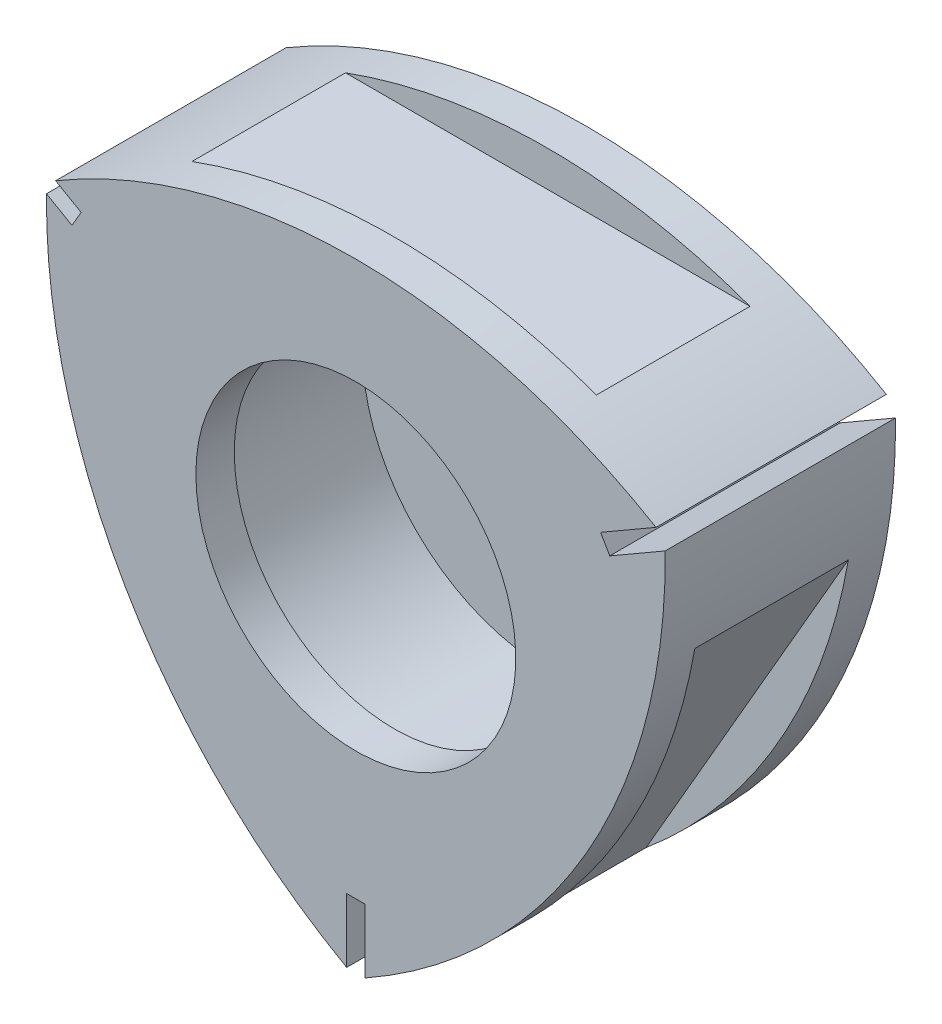
ISO-10303-21;
HEADER;
FILE_DESCRIPTION(('STEP AP214'),'2;1');
FILE_NAME('part.step','',(''),(''),'','','');
FILE_SCHEMA(('AUTOMOTIVE_DESIGN { 1 0 10303 214 1 1 1 1 }'));
ENDSEC;
DATA;
#1=APPLICATION_CONTEXT('core data for automotive mechanical design processes');
#2=APPLICATION_PROTOCOL_DEFINITION('international standard','automotive_design',2000,#1);
#3=PRODUCT_CONTEXT('',#1,'mechanical');
#4=PRODUCT('Part','Part','',(#3));
#5=PRODUCT_RELATED_PRODUCT_CATEGORY('part','',(#4));
#6=PRODUCT_DEFINITION_FORMATION('','',#4);
#7=PRODUCT_DEFINITION_CONTEXT('part definition',#1,'design');
#8=PRODUCT_DEFINITION('design','',#6,#7);
#9=PRODUCT_DEFINITION_SHAPE('','',#8);
#10=(LENGTH_UNIT() NAMED_UNIT(*) SI_UNIT(.MILLI.,.METRE.));
#11=(NAMED_UNIT(*) PLANE_ANGLE_UNIT() SI_UNIT($,.RADIAN.));
#12=(NAMED_UNIT(*) SI_UNIT($,.STERADIAN.) SOLID_ANGLE_UNIT());
#13=UNCERTAINTY_MEASURE_WITH_UNIT(LENGTH_MEASURE(1.E-05),#10,'distance_accuracy_value','');
#14=(GEOMETRIC_REPRESENTATION_CONTEXT(3) GLOBAL_UNCERTAINTY_ASSIGNED_CONTEXT((#13)) GLOBAL_UNIT_ASSIGNED_CONTEXT((#10,
#11,#12)) REPRESENTATION_CONTEXT('',''));
#15=CARTESIAN_POINT('',(0.,0.,0.));
#16=DIRECTION('',(0.,0.,1.));
#17=DIRECTION('',(1.,0.,0.));
#18=AXIS2_PLACEMENT_3D('',#15,#16,#17);
#19=CARTESIAN_POINT('',(-21.8238401709114,12.5999997743161,18.));
#20=DIRECTION('',(0.,0.,1.));
#21=DIRECTION('',(1.,0.,0.));
#22=AXIS2_PLACEMENT_3D('',#19,#20,#21);
#23=PLANE('',#22);
#24=CARTESIAN_POINT('',(-21.8238401709114,12.5999997743161,18.));
#25=DIRECTION('',(0.,0.,1.));
#26=DIRECTION('',(1.,0.,0.));
#27=AXIS2_PLACEMENT_3D('',#24,#25,#26);
#28=CIRCLE('',#27,46.);
#29=CARTESIAN_POINT('',(0.714793524428467,-27.500000115301,18.));
#30=VERTEX_POINT('',#29);
#31=CARTESIAN_POINT('',(24.1730952677357,13.1309708214793,18.));
#32=VERTEX_POINT('',#31);
#33=EDGE_CURVE('E247',#30,#32,#28,.T.);
#34=ORIENTED_EDGE('',*,*,#33,.T.);
#35=DIRECTION('',(-0.866025403784439,-0.5,0.));
#36=VECTOR('',#35,1.);
#37=CARTESIAN_POINT('',(24.1730952677357,13.1309708214793,18.));
#38=LINE('',#37,#36);
#39=CARTESIAN_POINT('',(19.8429682488135,10.6309708214793,18.));
#40=VERTEX_POINT('',#39);
#41=EDGE_CURVE('E245',#32,#40,#38,.T.);
#42=ORIENTED_EDGE('',*,*,#41,.T.);
#43=DIRECTION('',(-0.500000000000001,0.866025403784438,0.));
#44=VECTOR('',#43,1.);
#45=CARTESIAN_POINT('',(19.4855715863791,11.2499999992713,18.));
#46=LINE('',#45,#44);
#47=CARTESIAN_POINT('',(19.1281749245879,11.8690291759491,18.));
#48=VERTEX_POINT('',#47);
#49=EDGE_CURVE('E243',#40,#48,#46,.T.);
#50=ORIENTED_EDGE('',*,*,#49,.T.);
#51=DIRECTION('',(0.866025403784439,0.5,0.));
#52=VECTOR('',#51,1.);
#53=CARTESIAN_POINT('',(23.4583019435101,14.3690291759491,18.));
#54=LINE('',#53,#52);
#55=CARTESIAN_POINT('',(23.4583019435101,14.3690291759491,18.));
#56=VERTEX_POINT('',#55);
#57=EDGE_CURVE('E241',#48,#56,#54,.T.);
#58=ORIENTED_EDGE('',*,*,#57,.T.);
#59=CARTESIAN_POINT('',(0.,-25.2,18.));
#60=DIRECTION('',(0.,0.,1.));
#61=DIRECTION('',(1.,0.,0.));
#62=AXIS2_PLACEMENT_3D('',#59,#60,#61);
#63=CIRCLE('',#62,46.);
#64=CARTESIAN_POINT('',(-23.4583019435102,14.3690291759491,18.));
#65=VERTEX_POINT('',#64);
#66=EDGE_CURVE('E239',#56,#65,#63,.T.);
#67=ORIENTED_EDGE('',*,*,#66,.T.);
#68=DIRECTION('',(0.866025403784439,-0.5,0.));
#69=VECTOR('',#68,1.);
#70=CARTESIAN_POINT('',(-23.4583019435102,14.3690291759491,18.));
#71=LINE('',#70,#69);
#72=CARTESIAN_POINT('',(-21.4664434131332,13.2190291172483,18.));
#73=VERTEX_POINT('',#72);
#74=EDGE_CURVE('E237',#65,#73,#71,.T.);
#75=ORIENTED_EDGE('',*,*,#74,.T.);
#76=DIRECTION('',(-0.5,-0.866025403784439,0.));
#77=VECTOR('',#76,1.);
#78=CARTESIAN_POINT('',(-21.8238401709114,12.5999997743161,18.));
#79=LINE('',#78,#77);
#80=CARTESIAN_POINT('',(-22.1812367367378,11.9809707638541,18.));
#81=VERTEX_POINT('',#80);
#82=EDGE_CURVE('E235',#73,#81,#79,.T.);
#83=ORIENTED_EDGE('',*,*,#82,.T.);
#84=DIRECTION('',(-0.866025403784439,0.5,0.));
#85=VECTOR('',#84,1.);
#86=CARTESIAN_POINT('',(-24.1730952671147,13.1309708225549,18.));
#87=LINE('',#86,#85);
#88=CARTESIAN_POINT('',(-24.1730952671147,13.1309708225549,18.));
#89=VERTEX_POINT('',#88);
#90=EDGE_CURVE('E233',#81,#89,#87,.T.);
#91=ORIENTED_EDGE('',*,*,#90,.T.);
#92=CARTESIAN_POINT('',(21.8238417480671,12.5999998722023,18.));
#93=DIRECTION('',(0.,0.,1.));
#94=DIRECTION('',(-1.,0.,0.));
#95=AXIS2_PLACEMENT_3D('',#92,#93,#94);
#96=CIRCLE('',#95,46.0000015753122);
#97=CARTESIAN_POINT('',(-0.714793876634833,-27.5000001669049,18.));
#98=VERTEX_POINT('',#97);
#99=EDGE_CURVE('E231',#89,#98,#96,.T.);
#100=ORIENTED_EDGE('',*,*,#99,.T.);
#101=DIRECTION('',(0.,1.,0.));
#102=VECTOR('',#101,1.);
#103=CARTESIAN_POINT('',(-0.714793847630263,-27.500000115301,18.));
#104=LINE('',#103,#102);
#105=CARTESIAN_POINT('',(-0.714793847630263,-22.5000001152989,18.));
#106=VERTEX_POINT('',#105);
#107=EDGE_CURVE('E229',#98,#106,#104,.T.);
#108=ORIENTED_EDGE('',*,*,#107,.T.);
#109=DIRECTION('',(1.,0.,0.));
#110=VECTOR('',#109,1.);
#111=CARTESIAN_POINT('',(0.,-22.5000001152989,18.));
#112=LINE('',#111,#110);
#113=CARTESIAN_POINT('',(0.714793524428464,-22.5000001152989,18.));
#114=VERTEX_POINT('',#113);
#115=EDGE_CURVE('E227',#106,#114,#112,.T.);
#116=ORIENTED_EDGE('',*,*,#115,.T.);
#117=DIRECTION('',(0.,-1.,0.));
#118=VECTOR('',#117,1.);
#119=CARTESIAN_POINT('',(0.714793524428467,-27.500000115301,18.));
#120=LINE('',#119,#118);
#121=EDGE_CURVE('E225',#114,#30,#120,.T.);
#122=ORIENTED_EDGE('',*,*,#121,.T.);
#123=EDGE_LOOP('',(#34,#42,#50,#58,#67,#75,#83,#91,#100,#108,#116,#122));
#124=FACE_BOUND('',#123,.T.);
#125=CARTESIAN_POINT('',(0.,0.,18.));
#126=DIRECTION('',(0.,0.,-1.));
#127=DIRECTION('',(-1.,0.,0.));
#128=AXIS2_PLACEMENT_3D('',#125,#126,#127);
#129=CIRCLE('',#128,12.5);
#130=CARTESIAN_POINT('',(-12.5,0.,18.));
#131=VERTEX_POINT('',#130);
#132=EDGE_CURVE('E298',#131,#131,#129,.T.);
#133=ORIENTED_EDGE('',*,*,#132,.T.);
#134=EDGE_LOOP('',(#133));
#135=FACE_BOUND('',#134,.T.);
#136=ADVANCED_FACE('F26',(#124,#135),#23,.T.);
#137=CARTESIAN_POINT('',(0.,-25.2,18.));
#138=DIRECTION('',(0.,0.,-1.));
#139=DIRECTION('',(-1.,0.,0.));
#140=AXIS2_PLACEMENT_3D('',#137,#138,#139);
#141=CYLINDRICAL_SURFACE('',#140,46.);
#142=CARTESIAN_POINT('',(0.,-25.2,0.));
#143=DIRECTION('',(0.,0.,1.));
#144=DIRECTION('',(1.,0.,0.));
#145=AXIS2_PLACEMENT_3D('',#142,#143,#144);
#146=CIRCLE('',#145,46.);
#147=CARTESIAN_POINT('',(23.4583019435101,14.3690291759491,0.));
#148=VERTEX_POINT('',#147);
#149=CARTESIAN_POINT('',(-23.4583019435102,14.3690291759491,0.));
#150=VERTEX_POINT('',#149);
#151=EDGE_CURVE('E267',#148,#150,#146,.T.);
#152=ORIENTED_EDGE('',*,*,#151,.T.);
#153=DIRECTION('',(0.,0.,-1.));
#154=VECTOR('',#153,1.);
#155=CARTESIAN_POINT('',(-23.4583019435102,14.3690291759491,18.));
#156=LINE('',#155,#154);
#157=EDGE_CURVE('E201',#65,#150,#156,.T.);
#158=ORIENTED_EDGE('',*,*,#157,.F.);
#159=ORIENTED_EDGE('',*,*,#66,.F.);
#160=DIRECTION('',(0.,0.,-1.));
#161=VECTOR('',#160,1.);
#162=CARTESIAN_POINT('',(23.4583019435101,14.3690291759491,18.));
#163=LINE('',#162,#161);
#164=EDGE_CURVE('E198',#56,#148,#163,.T.);
#165=ORIENTED_EDGE('',*,*,#164,.T.);
#166=EDGE_LOOP('',(#152,#158,#159,#165));
#167=FACE_BOUND('',#166,.T.);
#168=CARTESIAN_POINT('',(0.,-25.2,15.));
#169=DIRECTION('',(0.,0.,-1.));
#170=DIRECTION('',(-1.,0.,0.));
#171=AXIS2_PLACEMENT_3D('',#168,#169,#170);
#172=CIRCLE('',#171,46.);
#173=CARTESIAN_POINT('',(-15.8037970121107,18.,15.));
#174=VERTEX_POINT('',#173);
#175=CARTESIAN_POINT('',(15.8037970121107,18.,15.));
#176=VERTEX_POINT('',#175);
#177=EDGE_CURVE('E178',#174,#176,#172,.T.);
#178=ORIENTED_EDGE('',*,*,#177,.F.);
#179=DIRECTION('',(0.,0.,-1.));
#180=VECTOR('',#179,1.);
#181=CARTESIAN_POINT('',(-15.8037970121107,18.,18.));
#182=LINE('',#181,#180);
#183=CARTESIAN_POINT('',(-15.8037970121107,18.,3.));
#184=VERTEX_POINT('',#183);
#185=EDGE_CURVE('E180',#174,#184,#182,.T.);
#186=ORIENTED_EDGE('',*,*,#185,.T.);
#187=CARTESIAN_POINT('',(0.,-25.2,3.));
#188=DIRECTION('',(0.,0.,-1.));
#189=DIRECTION('',(-1.,0.,0.));
#190=AXIS2_PLACEMENT_3D('',#187,#188,#189);
#191=CIRCLE('',#190,46.);
#192=CARTESIAN_POINT('',(15.8037970121107,18.,3.));
#193=VERTEX_POINT('',#192);
#194=EDGE_CURVE('E186',#184,#193,#191,.T.);
#195=ORIENTED_EDGE('',*,*,#194,.T.);
#196=DIRECTION('',(0.,0.,-1.));
#197=VECTOR('',#196,1.);
#198=CARTESIAN_POINT('',(15.8037970121107,18.,18.));
#199=LINE('',#198,#197);
#200=EDGE_CURVE('E183',#193,#176,#199,.F.);
#201=ORIENTED_EDGE('',*,*,#200,.T.);
#202=EDGE_LOOP('',(#178,#186,#195,#201));
#203=FACE_BOUND('',#202,.T.);
#204=ADVANCED_FACE('F318',(#167,#203),#141,.T.);
#205=CARTESIAN_POINT('',(-21.8238401709114,12.5999997743161,18.));
#206=DIRECTION('',(0.,0.,-1.));
#207=DIRECTION('',(-1.,0.,0.));
#208=AXIS2_PLACEMENT_3D('',#205,#206,#207);
#209=CYLINDRICAL_SURFACE('',#208,46.);
#210=DIRECTION('',(0.,0.,-1.));
#211=VECTOR('',#210,1.);
#212=CARTESIAN_POINT('',(7.68655850595176,-22.6864901323407,18.));
#213=LINE('',#212,#211);
#214=CARTESIAN_POINT('',(7.68655850595176,-22.6864901323407,3.));
#215=VERTEX_POINT('',#214);
#216=CARTESIAN_POINT('',(7.68655850595176,-22.6864901323407,15.));
#217=VERTEX_POINT('',#216);
#218=EDGE_CURVE('E173',#215,#217,#213,.F.);
#219=ORIENTED_EDGE('',*,*,#218,.T.);
#220=CARTESIAN_POINT('',(-21.8238401709114,12.5999997743161,15.));
#221=DIRECTION('',(0.,0.,1.));
#222=DIRECTION('',(1.,0.,0.));
#223=AXIS2_PLACEMENT_3D('',#220,#221,#222);
#224=CIRCLE('',#223,46.);
#225=CARTESIAN_POINT('',(23.4903558370681,4.68648979767386,15.));
#226=VERTEX_POINT('',#225);
#227=EDGE_CURVE('E155',#217,#226,#224,.T.);
#228=ORIENTED_EDGE('',*,*,#227,.T.);
#229=DIRECTION('',(0.,0.,-1.));
#230=VECTOR('',#229,1.);
#231=CARTESIAN_POINT('',(23.4903558370681,4.68648979767386,18.));
#232=LINE('',#231,#230);
#233=CARTESIAN_POINT('',(23.4903558370681,4.68648979767386,3.));
#234=VERTEX_POINT('',#233);
#235=EDGE_CURVE('E170',#226,#234,#232,.T.);
#236=ORIENTED_EDGE('',*,*,#235,.T.);
#237=CARTESIAN_POINT('',(-21.8238401709114,12.5999997743161,3.));
#238=DIRECTION('',(0.,0.,1.));
#239=DIRECTION('',(1.,0.,0.));
#240=AXIS2_PLACEMENT_3D('',#237,#238,#239);
#241=CIRCLE('',#240,46.);
#242=EDGE_CURVE('E176',#215,#234,#241,.T.);
#243=ORIENTED_EDGE('',*,*,#242,.F.);
#244=EDGE_LOOP('',(#219,#228,#236,#243));
#245=FACE_BOUND('',#244,.T.);
#246=CARTESIAN_POINT('',(-21.8238401709114,12.5999997743161,0.));
#247=DIRECTION('',(0.,0.,1.));
#248=DIRECTION('',(1.,0.,0.));
#249=AXIS2_PLACEMENT_3D('',#246,#247,#248);
#250=CIRCLE('',#249,46.);
#251=CARTESIAN_POINT('',(0.714793524428467,-27.500000115301,0.));
#252=VERTEX_POINT('',#251);
#253=CARTESIAN_POINT('',(24.1730952677357,13.1309708214793,0.));
#254=VERTEX_POINT('',#253);
#255=EDGE_CURVE('E277',#252,#254,#250,.T.);
#256=ORIENTED_EDGE('',*,*,#255,.T.);
#257=DIRECTION('',(0.,0.,-1.));
#258=VECTOR('',#257,1.);
#259=CARTESIAN_POINT('',(24.1730952677357,13.1309708214793,18.));
#260=LINE('',#259,#258);
#261=EDGE_CURVE('E189',#32,#254,#260,.T.);
#262=ORIENTED_EDGE('',*,*,#261,.F.);
#263=ORIENTED_EDGE('',*,*,#33,.F.);
#264=DIRECTION('',(0.,0.,-1.));
#265=VECTOR('',#264,1.);
#266=CARTESIAN_POINT('',(0.714793524428467,-27.500000115301,18.));
#267=LINE('',#266,#265);
#268=EDGE_CURVE('E222',#30,#252,#267,.T.);
#269=ORIENTED_EDGE('',*,*,#268,.T.);
#270=EDGE_LOOP('',(#256,#262,#263,#269));
#271=FACE_BOUND('',#270,.T.);
#272=ADVANCED_FACE('F28',(#245,#271),#209,.T.);
#273=CARTESIAN_POINT('',(24.1730952677357,13.1309708214793,18.));
#274=DIRECTION('',(0.5,-0.866025403784439,0.));
#275=DIRECTION('',(0.866025403784439,0.5,0.));
#276=AXIS2_PLACEMENT_3D('',#273,#274,#275);
#277=PLANE('',#276);
#278=DIRECTION('',(-0.866025403784439,-0.5,0.));
#279=VECTOR('',#278,1.);
#280=CARTESIAN_POINT('',(24.1730952677357,13.1309708214793,0.));
#281=LINE('',#280,#279);
#282=CARTESIAN_POINT('',(19.8429682488135,10.6309708214793,0.));
#283=VERTEX_POINT('',#282);
#284=EDGE_CURVE('E274',#254,#283,#281,.T.);
#285=ORIENTED_EDGE('',*,*,#284,.T.);
#286=DIRECTION('',(0.,0.,-1.));
#287=VECTOR('',#286,1.);
#288=CARTESIAN_POINT('',(19.8429682488135,10.6309708214793,18.));
#289=LINE('',#288,#287);
#290=EDGE_CURVE('E192',#40,#283,#289,.T.);
#291=ORIENTED_EDGE('',*,*,#290,.F.);
#292=ORIENTED_EDGE('',*,*,#41,.F.);
#293=ORIENTED_EDGE('',*,*,#261,.T.);
#294=EDGE_LOOP('',(#285,#291,#292,#293));
#295=FACE_BOUND('',#294,.T.);
#296=ADVANCED_FACE('F363',(#295),#277,.F.);
#297=CARTESIAN_POINT('',(19.4855715863791,11.2499999992713,18.));
#298=DIRECTION('',(-0.866025403784439,-0.499999999999999,0.));
#299=DIRECTION('',(0.499999999999999,-0.86602540378444,0.));
#300=AXIS2_PLACEMENT_3D('',#297,#298,#299);
#301=PLANE('',#300);
#302=DIRECTION('',(-0.499999999999999,0.866025403784439,0.));
#303=VECTOR('',#302,1.);
#304=CARTESIAN_POINT('',(19.4855715863791,11.2499999992713,0.));
#305=LINE('',#304,#303);
#306=CARTESIAN_POINT('',(19.1281749245879,11.8690291759491,0.));
#307=VERTEX_POINT('',#306);
#308=EDGE_CURVE('E272',#283,#307,#305,.T.);
#309=ORIENTED_EDGE('',*,*,#308,.T.);
#310=DIRECTION('',(0.,0.,-1.));
#311=VECTOR('',#310,1.);
#312=CARTESIAN_POINT('',(19.1281749245879,11.8690291759491,18.));
#313=LINE('',#312,#311);
#314=EDGE_CURVE('E195',#48,#307,#313,.T.);
#315=ORIENTED_EDGE('',*,*,#314,.F.);
#316=ORIENTED_EDGE('',*,*,#49,.F.);
#317=ORIENTED_EDGE('',*,*,#290,.T.);
#318=EDGE_LOOP('',(#309,#315,#316,#317));
#319=FACE_BOUND('',#318,.T.);
#320=ADVANCED_FACE('F360',(#319),#301,.F.);
#321=CARTESIAN_POINT('',(23.4583019435101,14.3690291759491,18.));
#322=DIRECTION('',(-0.5,0.866025403784438,0.));
#323=DIRECTION('',(-0.866025403784439,-0.5,0.));
#324=AXIS2_PLACEMENT_3D('',#321,#322,#323);
#325=PLANE('',#324);
#326=DIRECTION('',(0.866025403784439,0.5,0.));
#327=VECTOR('',#326,1.);
#328=CARTESIAN_POINT('',(23.4583019435101,14.3690291759491,0.));
#329=LINE('',#328,#327);
#330=EDGE_CURVE('E269',#307,#148,#329,.T.);
#331=ORIENTED_EDGE('',*,*,#330,.T.);
#332=ORIENTED_EDGE('',*,*,#164,.F.);
#333=ORIENTED_EDGE('',*,*,#57,.F.);
#334=ORIENTED_EDGE('',*,*,#314,.T.);
#335=EDGE_LOOP('',(#331,#332,#333,#334));
#336=FACE_BOUND('',#335,.T.);
#337=ADVANCED_FACE('F355',(#336),#325,.F.);
#338=CARTESIAN_POINT('',(-23.4583019435102,14.3690291759491,18.));
#339=DIRECTION('',(0.5,0.866025403784439,0.));
#340=DIRECTION('',(-0.866025403784439,0.5,0.));
#341=AXIS2_PLACEMENT_3D('',#338,#339,#340);
#342=PLANE('',#341);
#343=DIRECTION('',(0.866025403784439,-0.5,0.));
#344=VECTOR('',#343,1.);
#345=CARTESIAN_POINT('',(-23.4583019435102,14.3690291759491,0.));
#346=LINE('',#345,#344);
#347=CARTESIAN_POINT('',(-21.4664434131332,13.2190291172483,0.));
#348=VERTEX_POINT('',#347);
#349=EDGE_CURVE('E264',#150,#348,#346,.T.);
#350=ORIENTED_EDGE('',*,*,#349,.T.);
#351=DIRECTION('',(0.,0.,-1.));
#352=VECTOR('',#351,1.);
#353=CARTESIAN_POINT('',(-21.4664434131332,13.2190291172483,18.));
#354=LINE('',#353,#352);
#355=EDGE_CURVE('E204',#73,#348,#354,.T.);
#356=ORIENTED_EDGE('',*,*,#355,.F.);
#357=ORIENTED_EDGE('',*,*,#74,.F.);
#358=ORIENTED_EDGE('',*,*,#157,.T.);
#359=EDGE_LOOP('',(#350,#356,#357,#358));
#360=FACE_BOUND('',#359,.T.);
#361=ADVANCED_FACE('F352',(#360),#342,.F.);
#362=CARTESIAN_POINT('',(-21.8238401709114,12.5999997743161,18.));
#363=DIRECTION('',(0.86602540378444,-0.499999999999998,0.));
#364=DIRECTION('',(0.499999999999998,0.86602540378444,0.));
#365=AXIS2_PLACEMENT_3D('',#362,#363,#364);
#366=PLANE('',#365);
#367=DIRECTION('',(-0.499999999999998,-0.866025403784439,0.));
#368=VECTOR('',#367,1.);
#369=CARTESIAN_POINT('',(-21.8238401709114,12.5999997743161,0.));
#370=LINE('',#369,#368);
#371=CARTESIAN_POINT('',(-22.1812367367378,11.9809707638541,0.));
#372=VERTEX_POINT('',#371);
#373=EDGE_CURVE('E262',#348,#372,#370,.T.);
#374=ORIENTED_EDGE('',*,*,#373,.T.);
#375=DIRECTION('',(0.,0.,-1.));
#376=VECTOR('',#375,1.);
#377=CARTESIAN_POINT('',(-22.1812367367378,11.9809707638541,18.));
#378=LINE('',#377,#376);
#379=EDGE_CURVE('E207',#81,#372,#378,.T.);
#380=ORIENTED_EDGE('',*,*,#379,.F.);
#381=ORIENTED_EDGE('',*,*,#82,.F.);
#382=ORIENTED_EDGE('',*,*,#355,.T.);
#383=EDGE_LOOP('',(#374,#380,#381,#382));
#384=FACE_BOUND('',#383,.T.);
#385=ADVANCED_FACE('F348',(#384),#366,.F.);
#386=CARTESIAN_POINT('',(-24.1730952671147,13.1309708225549,18.));
#387=DIRECTION('',(-0.5,-0.866025403784439,0.));
#388=DIRECTION('',(0.866025403784439,-0.5,0.));
#389=AXIS2_PLACEMENT_3D('',#386,#387,#388);
#390=PLANE('',#389);
#391=DIRECTION('',(-0.866025403784439,0.5,0.));
#392=VECTOR('',#391,1.);
#393=CARTESIAN_POINT('',(-24.1730952671147,13.1309708225549,0.));
#394=LINE('',#393,#392);
#395=CARTESIAN_POINT('',(-24.1730952671147,13.1309708225549,0.));
#396=VERTEX_POINT('',#395);
#397=EDGE_CURVE('E259',#372,#396,#394,.T.);
#398=ORIENTED_EDGE('',*,*,#397,.T.);
#399=DIRECTION('',(0.,0.,-1.));
#400=VECTOR('',#399,1.);
#401=CARTESIAN_POINT('',(-24.1730952671147,13.1309708225549,18.));
#402=LINE('',#401,#400);
#403=EDGE_CURVE('E210',#89,#396,#402,.T.);
#404=ORIENTED_EDGE('',*,*,#403,.F.);
#405=ORIENTED_EDGE('',*,*,#90,.F.);
#406=ORIENTED_EDGE('',*,*,#379,.T.);
#407=EDGE_LOOP('',(#398,#404,#405,#406));
#408=FACE_BOUND('',#407,.T.);
#409=ADVANCED_FACE('F345',(#408),#390,.F.);
#410=CARTESIAN_POINT('',(21.8238401678747,12.599999458551,18.));
#411=DIRECTION('',(0.,0.,-1.));
#412=DIRECTION('',(-1.,0.,0.));
#413=AXIS2_PLACEMENT_3D('',#410,#411,#412);
#414=CYLINDRICAL_SURFACE('',#413,45.9999999408032);
#415=DIRECTION('',(0.,0.,-1.));
#416=VECTOR('',#415,1.);
#417=CARTESIAN_POINT('',(-23.4903558343271,4.68648979292632,18.));
#418=LINE('',#417,#416);
#419=CARTESIAN_POINT('',(-23.4903558343271,4.6864897929263,3.));
#420=VERTEX_POINT('',#419);
#421=CARTESIAN_POINT('',(-23.4903558343271,4.6864897929263,15.));
#422=VERTEX_POINT('',#421);
#423=EDGE_CURVE('E154',#420,#422,#418,.F.);
#424=ORIENTED_EDGE('',*,*,#423,.T.);
#425=CARTESIAN_POINT('',(21.8238401678747,12.599999458551,15.));
#426=DIRECTION('',(0.,0.,1.));
#427=DIRECTION('',(1.,0.,0.));
#428=AXIS2_PLACEMENT_3D('',#425,#426,#427);
#429=CIRCLE('',#428,45.9999999408032);
#430=CARTESIAN_POINT('',(-7.68655823675059,-22.6864905986108,15.));
#431=VERTEX_POINT('',#430);
#432=EDGE_CURVE('E11',#422,#431,#429,.T.);
#433=ORIENTED_EDGE('',*,*,#432,.T.);
#434=DIRECTION('',(0.,0.,-1.));
#435=VECTOR('',#434,1.);
#436=CARTESIAN_POINT('',(-7.68655823675058,-22.6864905986108,18.));
#437=LINE('',#436,#435);
#438=CARTESIAN_POINT('',(-7.68655823675059,-22.6864905986108,3.));
#439=VERTEX_POINT('',#438);
#440=EDGE_CURVE('E34',#431,#439,#437,.T.);
#441=ORIENTED_EDGE('',*,*,#440,.T.);
#442=CARTESIAN_POINT('',(21.8238401678747,12.599999458551,3.));
#443=DIRECTION('',(0.,0.,1.));
#444=DIRECTION('',(1.,0.,0.));
#445=AXIS2_PLACEMENT_3D('',#442,#443,#444);
#446=CIRCLE('',#445,45.9999999408032);
#447=EDGE_CURVE('E149',#420,#439,#446,.T.);
#448=ORIENTED_EDGE('',*,*,#447,.F.);
#449=EDGE_LOOP('',(#424,#433,#441,#448));
#450=FACE_BOUND('',#449,.T.);
#451=CARTESIAN_POINT('',(21.8238401678747,12.599999458551,0.));
#452=DIRECTION('',(0.,0.,1.));
#453=DIRECTION('',(1.,0.,0.));
#454=AXIS2_PLACEMENT_3D('',#451,#452,#453);
#455=CIRCLE('',#454,45.9999999408032);
#456=CARTESIAN_POINT('',(-0.714793876634833,-27.5000001669049,0.));
#457=VERTEX_POINT('',#456);
#458=EDGE_CURVE('E257',#396,#457,#455,.T.);
#459=ORIENTED_EDGE('',*,*,#458,.T.);
#460=DIRECTION('',(0.,0.,-1.));
#461=VECTOR('',#460,1.);
#462=CARTESIAN_POINT('',(-0.714793876634833,-27.5000001669049,18.));
#463=LINE('',#462,#461);
#464=EDGE_CURVE('E213',#98,#457,#463,.T.);
#465=ORIENTED_EDGE('',*,*,#464,.F.);
#466=ORIENTED_EDGE('',*,*,#99,.F.);
#467=ORIENTED_EDGE('',*,*,#403,.T.);
#468=EDGE_LOOP('',(#459,#465,#466,#467));
#469=FACE_BOUND('',#468,.T.);
#470=ADVANCED_FACE('F164',(#450,#469),#414,.T.);
#471=CARTESIAN_POINT('',(-0.714793847630263,-27.500000115301,18.));
#472=DIRECTION('',(-1.,0.,0.));
#473=DIRECTION('',(0.,-1.,0.));
#474=AXIS2_PLACEMENT_3D('',#471,#472,#473);
#475=PLANE('',#474);
#476=DIRECTION('',(0.,1.,0.));
#477=VECTOR('',#476,1.);
#478=CARTESIAN_POINT('',(-0.714793847630263,-27.500000115301,0.));
#479=LINE('',#478,#477);
#480=CARTESIAN_POINT('',(-0.714793847630263,-22.5000001152989,0.));
#481=VERTEX_POINT('',#480);
#482=EDGE_CURVE('E254',#457,#481,#479,.T.);
#483=ORIENTED_EDGE('',*,*,#482,.T.);
#484=DIRECTION('',(0.,0.,-1.));
#485=VECTOR('',#484,1.);
#486=CARTESIAN_POINT('',(-0.714793847630263,-22.5000001152989,18.));
#487=LINE('',#486,#485);
#488=EDGE_CURVE('E216',#106,#481,#487,.T.);
#489=ORIENTED_EDGE('',*,*,#488,.F.);
#490=ORIENTED_EDGE('',*,*,#107,.F.);
#491=ORIENTED_EDGE('',*,*,#464,.T.);
#492=EDGE_LOOP('',(#483,#489,#490,#491));
#493=FACE_BOUND('',#492,.T.);
#494=ADVANCED_FACE('F338',(#493),#475,.F.);
#495=CARTESIAN_POINT('',(0.,-22.5000001152989,18.));
#496=DIRECTION('',(0.,1.,0.));
#497=DIRECTION('',(0.,0.,1.));
#498=AXIS2_PLACEMENT_3D('',#495,#496,#497);
#499=PLANE('',#498);
#500=DIRECTION('',(1.,0.,0.));
#501=VECTOR('',#500,1.);
#502=CARTESIAN_POINT('',(0.,-22.5000001152989,0.));
#503=LINE('',#502,#501);
#504=CARTESIAN_POINT('',(0.714793524428464,-22.5000001152989,0.));
#505=VERTEX_POINT('',#504);
#506=EDGE_CURVE('E252',#481,#505,#503,.T.);
#507=ORIENTED_EDGE('',*,*,#506,.T.);
#508=DIRECTION('',(0.,0.,-1.));
#509=VECTOR('',#508,1.);
#510=CARTESIAN_POINT('',(0.714793524428464,-22.5000001152989,18.));
#511=LINE('',#510,#509);
#512=EDGE_CURVE('E219',#114,#505,#511,.T.);
#513=ORIENTED_EDGE('',*,*,#512,.F.);
#514=ORIENTED_EDGE('',*,*,#115,.F.);
#515=ORIENTED_EDGE('',*,*,#488,.T.);
#516=EDGE_LOOP('',(#507,#513,#514,#515));
#517=FACE_BOUND('',#516,.T.);
#518=ADVANCED_FACE('F334',(#517),#499,.F.);
#519=CARTESIAN_POINT('',(0.714793524428467,-27.500000115301,18.));
#520=DIRECTION('',(1.,0.,0.));
#521=DIRECTION('',(0.,1.,0.));
#522=AXIS2_PLACEMENT_3D('',#519,#520,#521);
#523=PLANE('',#522);
#524=DIRECTION('',(0.,-1.,0.));
#525=VECTOR('',#524,1.);
#526=CARTESIAN_POINT('',(0.714793524428467,-27.500000115301,0.));
#527=LINE('',#526,#525);
#528=EDGE_CURVE('E249',#505,#252,#527,.T.);
#529=ORIENTED_EDGE('',*,*,#528,.T.);
#530=ORIENTED_EDGE('',*,*,#268,.F.);
#531=ORIENTED_EDGE('',*,*,#121,.F.);
#532=ORIENTED_EDGE('',*,*,#512,.T.);
#533=EDGE_LOOP('',(#529,#530,#531,#532));
#534=FACE_BOUND('',#533,.T.);
#535=ADVANCED_FACE('F331',(#534),#523,.F.);
#536=CARTESIAN_POINT('',(-21.8238401709114,12.5999997743161,0.));
#537=DIRECTION('',(0.,0.,1.));
#538=DIRECTION('',(1.,0.,0.));
#539=AXIS2_PLACEMENT_3D('',#536,#537,#538);
#540=PLANE('',#539);
#541=ORIENTED_EDGE('',*,*,#255,.F.);
#542=ORIENTED_EDGE('',*,*,#528,.F.);
#543=ORIENTED_EDGE('',*,*,#506,.F.);
#544=ORIENTED_EDGE('',*,*,#482,.F.);
#545=ORIENTED_EDGE('',*,*,#458,.F.);
#546=ORIENTED_EDGE('',*,*,#397,.F.);
#547=ORIENTED_EDGE('',*,*,#373,.F.);
#548=ORIENTED_EDGE('',*,*,#349,.F.);
#549=ORIENTED_EDGE('',*,*,#151,.F.);
#550=ORIENTED_EDGE('',*,*,#330,.F.);
#551=ORIENTED_EDGE('',*,*,#308,.F.);
#552=ORIENTED_EDGE('',*,*,#284,.F.);
#553=EDGE_LOOP('',(#541,#542,#543,#544,#545,#546,#547,#548,#549,#550,#551,#552));
#554=FACE_BOUND('',#553,.T.);
#555=ADVANCED_FACE('F329',(#554),#540,.F.);
#556=CARTESIAN_POINT('',(0.,18.,15.));
#557=DIRECTION('',(0.,-1.,0.));
#558=DIRECTION('',(1.,0.,0.));
#559=AXIS2_PLACEMENT_3D('',#556,#557,#558);
#560=PLANE('',#559);
#561=DIRECTION('',(-1.,0.,0.));
#562=VECTOR('',#561,1.);
#563=CARTESIAN_POINT('',(-18.,18.,15.));
#564=LINE('',#563,#562);
#565=EDGE_CURVE('E279',#176,#174,#564,.T.);
#566=ORIENTED_EDGE('',*,*,#565,.F.);
#567=ORIENTED_EDGE('',*,*,#200,.F.);
#568=DIRECTION('',(-1.,0.,0.));
#569=VECTOR('',#568,1.);
#570=CARTESIAN_POINT('',(0.,18.,3.));
#571=LINE('',#570,#569);
#572=EDGE_CURVE('E282',#193,#184,#571,.T.);
#573=ORIENTED_EDGE('',*,*,#572,.T.);
#574=ORIENTED_EDGE('',*,*,#185,.F.);
#575=EDGE_LOOP('',(#566,#567,#573,#574));
#576=FACE_BOUND('',#575,.T.);
#577=ADVANCED_FACE('F410',(#576),#560,.F.);
#578=CARTESIAN_POINT('',(-18.,18.,15.));
#579=DIRECTION('',(0.,0.,-1.));
#580=DIRECTION('',(-1.,0.,0.));
#581=AXIS2_PLACEMENT_3D('',#578,#579,#580);
#582=PLANE('',#581);
#583=ORIENTED_EDGE('',*,*,#177,.T.);
#584=ORIENTED_EDGE('',*,*,#565,.T.);
#585=EDGE_LOOP('',(#583,#584));
#586=FACE_BOUND('',#585,.T.);
#587=ADVANCED_FACE('F408',(#586),#582,.T.);
#588=CARTESIAN_POINT('',(-18.,18.,3.));
#589=DIRECTION('',(0.,0.,-1.));
#590=DIRECTION('',(-1.,0.,0.));
#591=AXIS2_PLACEMENT_3D('',#588,#589,#590);
#592=PLANE('',#591);
#593=ORIENTED_EDGE('',*,*,#572,.F.);
#594=ORIENTED_EDGE('',*,*,#194,.F.);
#595=EDGE_LOOP('',(#593,#594));
#596=FACE_BOUND('',#595,.T.);
#597=ADVANCED_FACE('F412',(#596),#592,.F.);
#598=CARTESIAN_POINT('',(24.5884572681199,6.58845726811978,15.));
#599=DIRECTION('',(-0.866025403784436,0.500000000000004,0.));
#600=DIRECTION('',(-0.500000000000004,-0.866025403784436,0.));
#601=AXIS2_PLACEMENT_3D('',#598,#599,#600);
#602=PLANE('',#601);
#603=DIRECTION('',(0.500000000000004,0.866025403784436,0.));
#604=VECTOR('',#603,1.);
#605=CARTESIAN_POINT('',(15.5884572681199,-9.00000000000008,15.));
#606=LINE('',#605,#604);
#607=EDGE_CURVE('E285',#217,#226,#606,.T.);
#608=ORIENTED_EDGE('',*,*,#607,.F.);
#609=ORIENTED_EDGE('',*,*,#218,.F.);
#610=DIRECTION('',(0.500000000000004,0.866025403784436,0.));
#611=VECTOR('',#610,1.);
#612=CARTESIAN_POINT('',(24.5884572681199,6.58845726811978,3.));
#613=LINE('',#612,#611);
#614=EDGE_CURVE('E47',#215,#234,#613,.T.);
#615=ORIENTED_EDGE('',*,*,#614,.T.);
#616=ORIENTED_EDGE('',*,*,#235,.F.);
#617=EDGE_LOOP('',(#608,#609,#615,#616));
#618=FACE_BOUND('',#617,.T.);
#619=ADVANCED_FACE('F414',(#618),#602,.F.);
#620=CARTESIAN_POINT('',(6.58845726811977,-24.5884572681199,15.));
#621=DIRECTION('',(0.,0.,1.));
#622=DIRECTION('',(1.,0.,0.));
#623=AXIS2_PLACEMENT_3D('',#620,#621,#622);
#624=PLANE('',#623);
#625=ORIENTED_EDGE('',*,*,#607,.T.);
#626=ORIENTED_EDGE('',*,*,#227,.F.);
#627=EDGE_LOOP('',(#625,#626));
#628=FACE_BOUND('',#627,.T.);
#629=ADVANCED_FACE('F420',(#628),#624,.F.);
#630=CARTESIAN_POINT('',(6.58845726811977,-24.5884572681199,3.));
#631=DIRECTION('',(0.,0.,1.));
#632=DIRECTION('',(1.,0.,0.));
#633=AXIS2_PLACEMENT_3D('',#630,#631,#632);
#634=PLANE('',#633);
#635=ORIENTED_EDGE('',*,*,#242,.T.);
#636=ORIENTED_EDGE('',*,*,#614,.F.);
#637=EDGE_LOOP('',(#635,#636));
#638=FACE_BOUND('',#637,.T.);
#639=ADVANCED_FACE('F520',(#638),#634,.T.);
#640=CARTESIAN_POINT('',(-6.5884572681198,-24.5884572681199,15.));
#641=DIRECTION('',(0.866025403784436,0.500000000000004,0.));
#642=DIRECTION('',(-0.500000000000004,0.866025403784437,0.));
#643=AXIS2_PLACEMENT_3D('',#640,#641,#642);
#644=PLANE('',#643);
#645=DIRECTION('',(0.500000000000004,-0.866025403784436,0.));
#646=VECTOR('',#645,1.);
#647=CARTESIAN_POINT('',(-15.5884572681199,-9.00000000000008,15.));
#648=LINE('',#647,#646);
#649=EDGE_CURVE('E161',#422,#431,#648,.T.);
#650=ORIENTED_EDGE('',*,*,#649,.F.);
#651=ORIENTED_EDGE('',*,*,#423,.F.);
#652=DIRECTION('',(0.500000000000004,-0.866025403784436,0.));
#653=VECTOR('',#652,1.);
#654=CARTESIAN_POINT('',(-6.5884572681198,-24.5884572681199,3.));
#655=LINE('',#654,#653);
#656=EDGE_CURVE('E40',#420,#439,#655,.T.);
#657=ORIENTED_EDGE('',*,*,#656,.T.);
#658=ORIENTED_EDGE('',*,*,#440,.F.);
#659=EDGE_LOOP('',(#650,#651,#657,#658));
#660=FACE_BOUND('',#659,.T.);
#661=ADVANCED_FACE('F159',(#660),#644,.F.);
#662=CARTESIAN_POINT('',(-24.5884572681199,6.58845726811979,15.));
#663=DIRECTION('',(0.,0.,1.));
#664=DIRECTION('',(1.,0.,0.));
#665=AXIS2_PLACEMENT_3D('',#662,#663,#664);
#666=PLANE('',#665);
#667=ORIENTED_EDGE('',*,*,#649,.T.);
#668=ORIENTED_EDGE('',*,*,#432,.F.);
#669=EDGE_LOOP('',(#667,#668));
#670=FACE_BOUND('',#669,.T.);
#671=ADVANCED_FACE('F316',(#670),#666,.F.);
#672=CARTESIAN_POINT('',(-24.5884572681199,6.58845726811979,3.));
#673=DIRECTION('',(0.,0.,1.));
#674=DIRECTION('',(1.,0.,0.));
#675=AXIS2_PLACEMENT_3D('',#672,#673,#674);
#676=PLANE('',#675);
#677=ORIENTED_EDGE('',*,*,#447,.T.);
#678=ORIENTED_EDGE('',*,*,#656,.F.);
#679=EDGE_LOOP('',(#677,#678));
#680=FACE_BOUND('',#679,.T.);
#681=ADVANCED_FACE('F150',(#680),#676,.T.);
#682=CARTESIAN_POINT('',(0.,0.,15.));
#683=DIRECTION('',(0.,0.,1.));
#684=DIRECTION('',(1.,0.,0.));
#685=AXIS2_PLACEMENT_3D('',#682,#683,#684);
#686=CYLINDRICAL_SURFACE('',#685,12.5);
#687=CARTESIAN_POINT('',(0.,0.,15.));
#688=DIRECTION('',(0.,0.,-1.));
#689=DIRECTION('',(-1.,0.,0.));
#690=AXIS2_PLACEMENT_3D('',#687,#688,#689);
#691=CIRCLE('',#690,12.5);
#692=CARTESIAN_POINT('',(-12.5,0.,15.));
#693=VERTEX_POINT('',#692);
#694=EDGE_CURVE('E162',#693,#693,#691,.T.);
#695=ORIENTED_EDGE('',*,*,#694,.T.);
#696=EDGE_LOOP('',(#695));
#697=FACE_BOUND('',#696,.T.);
#698=ORIENTED_EDGE('',*,*,#132,.F.);
#699=EDGE_LOOP('',(#698));
#700=FACE_BOUND('',#699,.T.);
#701=ADVANCED_FACE('F303',(#697,#700),#686,.F.);
#702=CARTESIAN_POINT('',(0.,0.,15.));
#703=DIRECTION('',(0.,0.,-1.));
#704=DIRECTION('',(-1.,0.,0.));
#705=AXIS2_PLACEMENT_3D('',#702,#703,#704);
#706=PLANE('',#705);
#707=CARTESIAN_POINT('',(0.,0.,15.));
#708=DIRECTION('',(0.,0.,-1.));
#709=DIRECTION('',(-1.,0.,0.));
#710=AXIS2_PLACEMENT_3D('',#707,#708,#709);
#711=CIRCLE('',#710,14.5);
#712=CARTESIAN_POINT('',(-14.5,0.,15.));
#713=VERTEX_POINT('',#712);
#714=EDGE_CURVE('E289',#713,#713,#711,.T.);
#715=ORIENTED_EDGE('',*,*,#714,.T.);
#716=EDGE_LOOP('',(#715));
#717=FACE_BOUND('',#716,.T.);
#718=ORIENTED_EDGE('',*,*,#694,.F.);
#719=EDGE_LOOP('',(#718));
#720=FACE_BOUND('',#719,.T.);
#721=ADVANCED_FACE('F305',(#717,#720),#706,.T.);
#722=CARTESIAN_POINT('',(0.,0.,15.));
#723=DIRECTION('',(0.,0.,-1.));
#724=DIRECTION('',(-1.,0.,0.));
#725=AXIS2_PLACEMENT_3D('',#722,#723,#724);
#726=CYLINDRICAL_SURFACE('',#725,14.5);
#727=ORIENTED_EDGE('',*,*,#714,.F.);
#728=EDGE_LOOP('',(#727));
#729=FACE_BOUND('',#728,.T.);
#730=CARTESIAN_POINT('',(0.,0.,3.));
#731=DIRECTION('',(0.,0.,-1.));
#732=DIRECTION('',(-1.,0.,0.));
#733=AXIS2_PLACEMENT_3D('',#730,#731,#732);
#734=CIRCLE('',#733,14.5);
#735=CARTESIAN_POINT('',(-14.5,0.,3.));
#736=VERTEX_POINT('',#735);
#737=EDGE_CURVE('E292',#736,#736,#734,.T.);
#738=ORIENTED_EDGE('',*,*,#737,.T.);
#739=EDGE_LOOP('',(#738));
#740=FACE_BOUND('',#739,.T.);
#741=ADVANCED_FACE('F312',(#729,#740),#726,.F.);
#742=CARTESIAN_POINT('',(0.,0.,3.));
#743=DIRECTION('',(0.,0.,-1.));
#744=DIRECTION('',(-1.,0.,0.));
#745=AXIS2_PLACEMENT_3D('',#742,#743,#744);
#746=PLANE('',#745);
#747=ORIENTED_EDGE('',*,*,#737,.F.);
#748=EDGE_LOOP('',(#747));
#749=FACE_BOUND('',#748,.T.);
#750=ADVANCED_FACE('F553',(#749),#746,.F.);
#751=CLOSED_SHELL('',(#136,#204,#272,#296,#320,#337,#361,#385,#409,#470,#494,#518,#535,#555,
#577,#587,#597,#619,#629,#639,#661,#671,#681,#701,#721,#741,#750));
#752=MANIFOLD_SOLID_BREP('B2',#751);
#753=ADVANCED_BREP_SHAPE_REPRESENTATION('',(#18,#752),#14);
#754=SHAPE_DEFINITION_REPRESENTATION(#9,#753);
ENDSEC;
END-ISO-10303-21;
